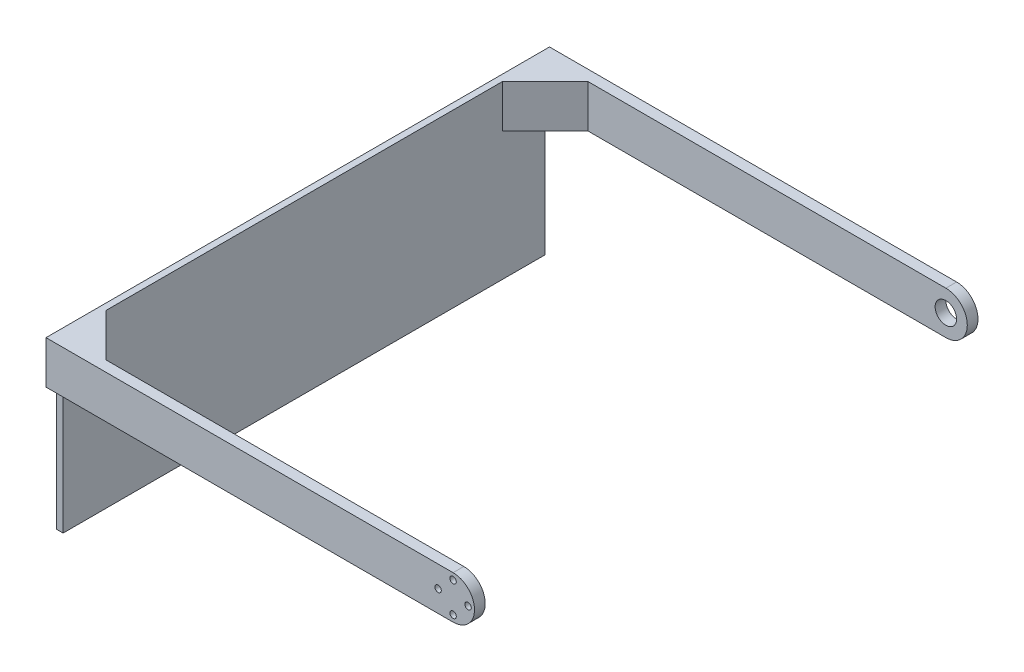
ISO-10303-21;
HEADER;
FILE_DESCRIPTION(('STEP AP214'),'2;1');
FILE_NAME('part.step','',(''),(''),'','','');
FILE_SCHEMA(('AUTOMOTIVE_DESIGN { 1 0 10303 214 1 1 1 1 }'));
ENDSEC;
DATA;
#1=APPLICATION_CONTEXT('core data for automotive mechanical design processes');
#2=APPLICATION_PROTOCOL_DEFINITION('international standard','automotive_design',2000,#1);
#3=PRODUCT_CONTEXT('',#1,'mechanical');
#4=PRODUCT('Part','Part','',(#3));
#5=PRODUCT_RELATED_PRODUCT_CATEGORY('part','',(#4));
#6=PRODUCT_DEFINITION_FORMATION('','',#4);
#7=PRODUCT_DEFINITION_CONTEXT('part definition',#1,'design');
#8=PRODUCT_DEFINITION('design','',#6,#7);
#9=PRODUCT_DEFINITION_SHAPE('','',#8);
#10=(LENGTH_UNIT() NAMED_UNIT(*) SI_UNIT(.MILLI.,.METRE.));
#11=(NAMED_UNIT(*) PLANE_ANGLE_UNIT() SI_UNIT($,.RADIAN.));
#12=(NAMED_UNIT(*) SI_UNIT($,.STERADIAN.) SOLID_ANGLE_UNIT());
#13=UNCERTAINTY_MEASURE_WITH_UNIT(LENGTH_MEASURE(1.E-05),#10,'distance_accuracy_value','');
#14=(GEOMETRIC_REPRESENTATION_CONTEXT(3) GLOBAL_UNCERTAINTY_ASSIGNED_CONTEXT((#13)) GLOBAL_UNIT_ASSIGNED_CONTEXT((#10,
#11,#12)) REPRESENTATION_CONTEXT('',''));
#15=CARTESIAN_POINT('',(0.,0.,0.));
#16=DIRECTION('',(0.,0.,1.));
#17=DIRECTION('',(1.,0.,0.));
#18=AXIS2_PLACEMENT_3D('',#15,#16,#17);
#19=CARTESIAN_POINT('',(0.,0.,-225.));
#20=DIRECTION('',(0.,0.,1.));
#21=DIRECTION('',(1.,0.,0.));
#22=AXIS2_PLACEMENT_3D('',#19,#20,#21);
#23=PLANE('',#22);
#24=DIRECTION('',(-1.,0.,0.));
#25=VECTOR('',#24,1.);
#26=CARTESIAN_POINT('',(0.,-10.,-225.));
#27=LINE('',#26,#25);
#28=CARTESIAN_POINT('',(-187.,-9.99999999999999,-225.));
#29=VERTEX_POINT('',#28);
#30=CARTESIAN_POINT('',(-190.,-9.99999999999998,-225.));
#31=VERTEX_POINT('',#30);
#32=EDGE_CURVE('E11',#29,#31,#27,.T.);
#33=ORIENTED_EDGE('',*,*,#32,.F.);
#34=DIRECTION('',(0.,-1.,0.));
#35=VECTOR('',#34,1.);
#36=CARTESIAN_POINT('',(-187.,-9.99999999999998,-225.));
#37=LINE('',#36,#35);
#38=CARTESIAN_POINT('',(-187.,-70.,-225.));
#39=VERTEX_POINT('',#38);
#40=EDGE_CURVE('E163',#29,#39,#37,.T.);
#41=ORIENTED_EDGE('',*,*,#40,.T.);
#42=DIRECTION('',(-1.,0.,0.));
#43=VECTOR('',#42,1.);
#44=CARTESIAN_POINT('',(-187.,-70.,-225.));
#45=LINE('',#44,#43);
#46=CARTESIAN_POINT('',(-190.,-70.,-225.));
#47=VERTEX_POINT('',#46);
#48=EDGE_CURVE('E224',#39,#47,#45,.T.);
#49=ORIENTED_EDGE('',*,*,#48,.T.);
#50=DIRECTION('',(0.,1.,0.));
#51=VECTOR('',#50,1.);
#52=CARTESIAN_POINT('',(-190.,-70.,-225.));
#53=LINE('',#52,#51);
#54=EDGE_CURVE('E228',#47,#31,#53,.T.);
#55=ORIENTED_EDGE('',*,*,#54,.T.);
#56=EDGE_LOOP('',(#33,#41,#49,#55));
#57=FACE_BOUND('',#56,.T.);
#58=ADVANCED_FACE('F39',(#57),#23,.F.);
#59=CARTESIAN_POINT('',(0.,0.,0.));
#60=DIRECTION('',(0.,0.,1.));
#61=DIRECTION('',(1.,0.,0.));
#62=AXIS2_PLACEMENT_3D('',#59,#60,#61);
#63=PLANE('',#62);
#64=CARTESIAN_POINT('',(0.,7.,0.));
#65=DIRECTION('',(0.,0.,1.));
#66=DIRECTION('',(1.,0.,0.));
#67=AXIS2_PLACEMENT_3D('',#64,#65,#66);
#68=CIRCLE('',#67,1.5);
#69=CARTESIAN_POINT('',(1.5,7.,0.));
#70=VERTEX_POINT('',#69);
#71=EDGE_CURVE('E251',#70,#70,#68,.T.);
#72=ORIENTED_EDGE('',*,*,#71,.T.);
#73=EDGE_LOOP('',(#72));
#74=FACE_BOUND('',#73,.T.);
#75=CARTESIAN_POINT('',(-7.,0.,0.));
#76=DIRECTION('',(0.,0.,1.));
#77=DIRECTION('',(1.,0.,0.));
#78=AXIS2_PLACEMENT_3D('',#75,#76,#77);
#79=CIRCLE('',#78,1.5);
#80=CARTESIAN_POINT('',(-5.5,0.,0.));
#81=VERTEX_POINT('',#80);
#82=EDGE_CURVE('E256',#81,#81,#79,.T.);
#83=ORIENTED_EDGE('',*,*,#82,.T.);
#84=EDGE_LOOP('',(#83));
#85=FACE_BOUND('',#84,.T.);
#86=CARTESIAN_POINT('',(0.,-7.,0.));
#87=DIRECTION('',(0.,0.,1.));
#88=DIRECTION('',(1.,0.,0.));
#89=AXIS2_PLACEMENT_3D('',#86,#87,#88);
#90=CIRCLE('',#89,1.5);
#91=CARTESIAN_POINT('',(1.5,-7.,0.));
#92=VERTEX_POINT('',#91);
#93=EDGE_CURVE('E264',#92,#92,#90,.T.);
#94=ORIENTED_EDGE('',*,*,#93,.T.);
#95=EDGE_LOOP('',(#94));
#96=FACE_BOUND('',#95,.T.);
#97=CARTESIAN_POINT('',(7.,0.,0.));
#98=DIRECTION('',(0.,0.,1.));
#99=DIRECTION('',(1.,0.,0.));
#100=AXIS2_PLACEMENT_3D('',#97,#98,#99);
#101=CIRCLE('',#100,1.5);
#102=CARTESIAN_POINT('',(8.5,0.,0.));
#103=VERTEX_POINT('',#102);
#104=EDGE_CURVE('E272',#103,#103,#101,.T.);
#105=ORIENTED_EDGE('',*,*,#104,.T.);
#106=EDGE_LOOP('',(#105));
#107=FACE_BOUND('',#106,.T.);
#108=DIRECTION('',(1.,0.,0.));
#109=VECTOR('',#108,1.);
#110=CARTESIAN_POINT('',(-190.,-9.99999999999998,0.));
#111=LINE('',#110,#109);
#112=CARTESIAN_POINT('',(-167.,-10.,0.));
#113=VERTEX_POINT('',#112);
#114=CARTESIAN_POINT('',(0.,-10.,0.));
#115=VERTEX_POINT('',#114);
#116=EDGE_CURVE('E305',#113,#115,#111,.T.);
#117=ORIENTED_EDGE('',*,*,#116,.F.);
#118=DIRECTION('',(0.,-1.,0.));
#119=VECTOR('',#118,1.);
#120=CARTESIAN_POINT('',(-167.,0.,0.));
#121=LINE('',#120,#119);
#122=CARTESIAN_POINT('',(-167.,9.99999999999998,0.));
#123=VERTEX_POINT('',#122);
#124=EDGE_CURVE('E64',#113,#123,#121,.F.);
#125=ORIENTED_EDGE('',*,*,#124,.T.);
#126=DIRECTION('',(-1.,0.,0.));
#127=VECTOR('',#126,1.);
#128=CARTESIAN_POINT('',(0.,10.,0.));
#129=LINE('',#128,#127);
#130=CARTESIAN_POINT('',(0.,10.,0.));
#131=VERTEX_POINT('',#130);
#132=EDGE_CURVE('E302',#131,#123,#129,.T.);
#133=ORIENTED_EDGE('',*,*,#132,.F.);
#134=CARTESIAN_POINT('',(0.,0.,0.));
#135=DIRECTION('',(0.,0.,1.));
#136=DIRECTION('',(1.,0.,0.));
#137=AXIS2_PLACEMENT_3D('',#134,#135,#136);
#138=CIRCLE('',#137,10.);
#139=EDGE_CURVE('E280',#115,#131,#138,.T.);
#140=ORIENTED_EDGE('',*,*,#139,.F.);
#141=EDGE_LOOP('',(#117,#125,#133,#140));
#142=FACE_BOUND('',#141,.T.);
#143=ADVANCED_FACE('F336',(#74,#85,#96,#107,#142),#63,.F.);
#144=CARTESIAN_POINT('',(0.,0.,5.));
#145=DIRECTION('',(0.,0.,1.));
#146=DIRECTION('',(1.,0.,0.));
#147=AXIS2_PLACEMENT_3D('',#144,#145,#146);
#148=PLANE('',#147);
#149=DIRECTION('',(-1.,0.,0.));
#150=VECTOR('',#149,1.);
#151=CARTESIAN_POINT('',(0.,10.,5.));
#152=LINE('',#151,#150);
#153=CARTESIAN_POINT('',(0.,10.,5.));
#154=VERTEX_POINT('',#153);
#155=CARTESIAN_POINT('',(-190.,9.99999999999998,5.));
#156=VERTEX_POINT('',#155);
#157=EDGE_CURVE('E288',#154,#156,#152,.T.);
#158=ORIENTED_EDGE('',*,*,#157,.T.);
#159=DIRECTION('',(0.,-1.,0.));
#160=VECTOR('',#159,1.);
#161=CARTESIAN_POINT('',(-190.,9.99999999999998,5.));
#162=LINE('',#161,#160);
#163=CARTESIAN_POINT('',(-190.,-9.99999999999998,5.));
#164=VERTEX_POINT('',#163);
#165=EDGE_CURVE('E292',#156,#164,#162,.T.);
#166=ORIENTED_EDGE('',*,*,#165,.T.);
#167=DIRECTION('',(1.,0.,0.));
#168=VECTOR('',#167,1.);
#169=CARTESIAN_POINT('',(-190.,-9.99999999999998,5.));
#170=LINE('',#169,#168);
#171=CARTESIAN_POINT('',(0.,-10.,5.));
#172=VERTEX_POINT('',#171);
#173=EDGE_CURVE('E295',#164,#172,#170,.T.);
#174=ORIENTED_EDGE('',*,*,#173,.T.);
#175=CARTESIAN_POINT('',(0.,0.,5.));
#176=DIRECTION('',(0.,0.,1.));
#177=DIRECTION('',(1.,0.,0.));
#178=AXIS2_PLACEMENT_3D('',#175,#176,#177);
#179=CIRCLE('',#178,10.);
#180=EDGE_CURVE('E284',#172,#154,#179,.T.);
#181=ORIENTED_EDGE('',*,*,#180,.T.);
#182=EDGE_LOOP('',(#158,#166,#174,#181));
#183=FACE_BOUND('',#182,.T.);
#184=CARTESIAN_POINT('',(-7.,0.,5.));
#185=DIRECTION('',(0.,0.,1.));
#186=DIRECTION('',(1.,0.,0.));
#187=AXIS2_PLACEMENT_3D('',#184,#185,#186);
#188=CIRCLE('',#187,1.5);
#189=CARTESIAN_POINT('',(-5.5,0.,5.));
#190=VERTEX_POINT('',#189);
#191=EDGE_CURVE('E260',#190,#190,#188,.T.);
#192=ORIENTED_EDGE('',*,*,#191,.F.);
#193=EDGE_LOOP('',(#192));
#194=FACE_BOUND('',#193,.T.);
#195=CARTESIAN_POINT('',(7.,0.,5.));
#196=DIRECTION('',(0.,0.,1.));
#197=DIRECTION('',(1.,0.,0.));
#198=AXIS2_PLACEMENT_3D('',#195,#196,#197);
#199=CIRCLE('',#198,1.5);
#200=CARTESIAN_POINT('',(8.5,0.,5.));
#201=VERTEX_POINT('',#200);
#202=EDGE_CURVE('E276',#201,#201,#199,.T.);
#203=ORIENTED_EDGE('',*,*,#202,.F.);
#204=EDGE_LOOP('',(#203));
#205=FACE_BOUND('',#204,.T.);
#206=CARTESIAN_POINT('',(0.,-7.,5.));
#207=DIRECTION('',(0.,0.,1.));
#208=DIRECTION('',(1.,0.,0.));
#209=AXIS2_PLACEMENT_3D('',#206,#207,#208);
#210=CIRCLE('',#209,1.5);
#211=CARTESIAN_POINT('',(1.5,-7.,5.));
#212=VERTEX_POINT('',#211);
#213=EDGE_CURVE('E268',#212,#212,#210,.T.);
#214=ORIENTED_EDGE('',*,*,#213,.F.);
#215=EDGE_LOOP('',(#214));
#216=FACE_BOUND('',#215,.T.);
#217=CARTESIAN_POINT('',(0.,7.,5.));
#218=DIRECTION('',(0.,0.,1.));
#219=DIRECTION('',(1.,0.,0.));
#220=AXIS2_PLACEMENT_3D('',#217,#218,#219);
#221=CIRCLE('',#220,1.5);
#222=CARTESIAN_POINT('',(1.5,7.,5.));
#223=VERTEX_POINT('',#222);
#224=EDGE_CURVE('E252',#223,#223,#221,.T.);
#225=ORIENTED_EDGE('',*,*,#224,.F.);
#226=EDGE_LOOP('',(#225));
#227=FACE_BOUND('',#226,.T.);
#228=ADVANCED_FACE('F346',(#183,#194,#205,#216,#227),#148,.T.);
#229=CARTESIAN_POINT('',(0.,0.,5.));
#230=DIRECTION('',(0.,0.,-1.));
#231=DIRECTION('',(-1.,0.,0.));
#232=AXIS2_PLACEMENT_3D('',#229,#230,#231);
#233=CYLINDRICAL_SURFACE('',#232,10.);
#234=ORIENTED_EDGE('',*,*,#139,.T.);
#235=DIRECTION('',(0.,0.,-1.));
#236=VECTOR('',#235,1.);
#237=CARTESIAN_POINT('',(0.,10.,5.));
#238=LINE('',#237,#236);
#239=EDGE_CURVE('E318',#154,#131,#238,.T.);
#240=ORIENTED_EDGE('',*,*,#239,.F.);
#241=ORIENTED_EDGE('',*,*,#180,.F.);
#242=DIRECTION('',(0.,0.,-1.));
#243=VECTOR('',#242,1.);
#244=CARTESIAN_POINT('',(0.,-10.,5.));
#245=LINE('',#244,#243);
#246=EDGE_CURVE('E298',#172,#115,#245,.T.);
#247=ORIENTED_EDGE('',*,*,#246,.T.);
#248=EDGE_LOOP('',(#234,#240,#241,#247));
#249=FACE_BOUND('',#248,.T.);
#250=ADVANCED_FACE('F41',(#249),#233,.T.);
#251=CARTESIAN_POINT('',(0.,10.,5.));
#252=DIRECTION('',(0.,-1.,0.));
#253=DIRECTION('',(1.,0.,0.));
#254=AXIS2_PLACEMENT_3D('',#251,#252,#253);
#255=PLANE('',#254);
#256=DIRECTION('',(1.,0.,0.));
#257=VECTOR('',#256,1.);
#258=CARTESIAN_POINT('',(-190.,9.99999999999998,-230.));
#259=LINE('',#258,#257);
#260=CARTESIAN_POINT('',(-190.,9.99999999999998,-230.));
#261=VERTEX_POINT('',#260);
#262=CARTESIAN_POINT('',(0.,10.,-230.));
#263=VERTEX_POINT('',#262);
#264=EDGE_CURVE('E191',#261,#263,#259,.T.);
#265=ORIENTED_EDGE('',*,*,#264,.F.);
#266=DIRECTION('',(0.,0.,-1.));
#267=VECTOR('',#266,1.);
#268=CARTESIAN_POINT('',(-190.,9.99999999999998,5.));
#269=LINE('',#268,#267);
#270=EDGE_CURVE('E315',#156,#261,#269,.T.);
#271=ORIENTED_EDGE('',*,*,#270,.F.);
#272=ORIENTED_EDGE('',*,*,#157,.F.);
#273=ORIENTED_EDGE('',*,*,#239,.T.);
#274=ORIENTED_EDGE('',*,*,#132,.T.);
#275=DIRECTION('',(0.707106781186547,0.,0.707106781186548));
#276=VECTOR('',#275,1.);
#277=CARTESIAN_POINT('',(-187.,9.99999999999998,-20.));
#278=LINE('',#277,#276);
#279=CARTESIAN_POINT('',(-187.,9.99999999999998,-20.));
#280=VERTEX_POINT('',#279);
#281=EDGE_CURVE('E212',#280,#123,#278,.T.);
#282=ORIENTED_EDGE('',*,*,#281,.F.);
#283=DIRECTION('',(0.,0.,1.));
#284=VECTOR('',#283,1.);
#285=CARTESIAN_POINT('',(-187.,9.99999999999998,-225.));
#286=LINE('',#285,#284);
#287=CARTESIAN_POINT('',(-187.,9.99999999999998,-205.));
#288=VERTEX_POINT('',#287);
#289=EDGE_CURVE('E248',#288,#280,#286,.T.);
#290=ORIENTED_EDGE('',*,*,#289,.F.);
#291=DIRECTION('',(0.707106781186547,0.,-0.707106781186548));
#292=VECTOR('',#291,1.);
#293=CARTESIAN_POINT('',(-187.,9.99999999999998,-205.));
#294=LINE('',#293,#292);
#295=CARTESIAN_POINT('',(-167.,9.99999999999998,-225.));
#296=VERTEX_POINT('',#295);
#297=EDGE_CURVE('E148',#288,#296,#294,.T.);
#298=ORIENTED_EDGE('',*,*,#297,.T.);
#299=DIRECTION('',(1.,0.,0.));
#300=VECTOR('',#299,1.);
#301=CARTESIAN_POINT('',(-190.,9.99999999999998,-225.));
#302=LINE('',#301,#300);
#303=CARTESIAN_POINT('',(0.,10.,-225.));
#304=VERTEX_POINT('',#303);
#305=EDGE_CURVE('E184',#296,#304,#302,.T.);
#306=ORIENTED_EDGE('',*,*,#305,.T.);
#307=DIRECTION('',(0.,0.,1.));
#308=VECTOR('',#307,1.);
#309=CARTESIAN_POINT('',(0.,10.,-230.));
#310=LINE('',#309,#308);
#311=EDGE_CURVE('E194',#263,#304,#310,.T.);
#312=ORIENTED_EDGE('',*,*,#311,.F.);
#313=EDGE_LOOP('',(#265,#271,#272,#273,#274,#282,#290,#298,#306,#312));
#314=FACE_BOUND('',#313,.T.);
#315=ADVANCED_FACE('F333',(#314),#255,.F.);
#316=CARTESIAN_POINT('',(-190.,9.99999999999998,5.));
#317=DIRECTION('',(1.,0.,0.));
#318=DIRECTION('',(0.,0.,-1.));
#319=AXIS2_PLACEMENT_3D('',#316,#317,#318);
#320=PLANE('',#319);
#321=ORIENTED_EDGE('',*,*,#270,.T.);
#322=DIRECTION('',(0.,1.,0.));
#323=VECTOR('',#322,1.);
#324=CARTESIAN_POINT('',(-190.,-9.99999999999998,-230.));
#325=LINE('',#324,#323);
#326=CARTESIAN_POINT('',(-190.,-9.99999999999998,-230.));
#327=VERTEX_POINT('',#326);
#328=EDGE_CURVE('E187',#327,#261,#325,.T.);
#329=ORIENTED_EDGE('',*,*,#328,.F.);
#330=DIRECTION('',(0.,0.,1.));
#331=VECTOR('',#330,1.);
#332=CARTESIAN_POINT('',(-190.,-9.99999999999998,-230.));
#333=LINE('',#332,#331);
#334=EDGE_CURVE('E204',#327,#31,#333,.T.);
#335=ORIENTED_EDGE('',*,*,#334,.T.);
#336=ORIENTED_EDGE('',*,*,#54,.F.);
#337=DIRECTION('',(0.,0.,1.));
#338=VECTOR('',#337,1.);
#339=CARTESIAN_POINT('',(-190.,-70.,-225.));
#340=LINE('',#339,#338);
#341=CARTESIAN_POINT('',(-190.,-70.,0.));
#342=VERTEX_POINT('',#341);
#343=EDGE_CURVE('E231',#47,#342,#340,.T.);
#344=ORIENTED_EDGE('',*,*,#343,.T.);
#345=DIRECTION('',(0.,1.,0.));
#346=VECTOR('',#345,1.);
#347=CARTESIAN_POINT('',(-190.,9.99999999999998,0.));
#348=LINE('',#347,#346);
#349=CARTESIAN_POINT('',(-190.,-9.99999999999998,0.));
#350=VERTEX_POINT('',#349);
#351=EDGE_CURVE('E225',#342,#350,#348,.T.);
#352=ORIENTED_EDGE('',*,*,#351,.T.);
#353=DIRECTION('',(0.,0.,-1.));
#354=VECTOR('',#353,1.);
#355=CARTESIAN_POINT('',(-190.,-9.99999999999998,5.));
#356=LINE('',#355,#354);
#357=EDGE_CURVE('E312',#164,#350,#356,.T.);
#358=ORIENTED_EDGE('',*,*,#357,.F.);
#359=ORIENTED_EDGE('',*,*,#165,.F.);
#360=EDGE_LOOP('',(#321,#329,#335,#336,#344,#352,#358,#359));
#361=FACE_BOUND('',#360,.T.);
#362=ADVANCED_FACE('F351',(#361),#320,.F.);
#363=CARTESIAN_POINT('',(-190.,-9.99999999999998,5.));
#364=DIRECTION('',(0.,1.,0.));
#365=DIRECTION('',(-1.,0.,0.));
#366=AXIS2_PLACEMENT_3D('',#363,#364,#365);
#367=PLANE('',#366);
#368=CARTESIAN_POINT('',(-187.,-9.99999999999999,0.));
#369=VERTEX_POINT('',#368);
#370=EDGE_CURVE('E289',#350,#369,#111,.T.);
#371=ORIENTED_EDGE('',*,*,#370,.T.);
#372=DIRECTION('',(0.,0.,-1.));
#373=VECTOR('',#372,1.);
#374=CARTESIAN_POINT('',(-187.,-10.,-225.));
#375=LINE('',#374,#373);
#376=CARTESIAN_POINT('',(-187.,-10.,-20.));
#377=VERTEX_POINT('',#376);
#378=EDGE_CURVE('E321',#369,#377,#375,.T.);
#379=ORIENTED_EDGE('',*,*,#378,.T.);
#380=DIRECTION('',(0.707106781186547,0.,0.707106781186548));
#381=VECTOR('',#380,1.);
#382=CARTESIAN_POINT('',(-187.,-10.,-20.));
#383=LINE('',#382,#381);
#384=EDGE_CURVE('E211',#377,#113,#383,.T.);
#385=ORIENTED_EDGE('',*,*,#384,.T.);
#386=ORIENTED_EDGE('',*,*,#116,.T.);
#387=ORIENTED_EDGE('',*,*,#246,.F.);
#388=ORIENTED_EDGE('',*,*,#173,.F.);
#389=ORIENTED_EDGE('',*,*,#357,.T.);
#390=EDGE_LOOP('',(#371,#379,#385,#386,#387,#388,#389));
#391=FACE_BOUND('',#390,.T.);
#392=ADVANCED_FACE('F341',(#391),#367,.F.);
#393=CARTESIAN_POINT('',(7.,0.,5.));
#394=DIRECTION('',(0.,0.,-1.));
#395=DIRECTION('',(-1.,0.,0.));
#396=AXIS2_PLACEMENT_3D('',#393,#394,#395);
#397=CYLINDRICAL_SURFACE('',#396,1.5);
#398=ORIENTED_EDGE('',*,*,#202,.T.);
#399=EDGE_LOOP('',(#398));
#400=FACE_BOUND('',#399,.T.);
#401=ORIENTED_EDGE('',*,*,#104,.F.);
#402=EDGE_LOOP('',(#401));
#403=FACE_BOUND('',#402,.T.);
#404=ADVANCED_FACE('F412',(#400,#403),#397,.F.);
#405=CARTESIAN_POINT('',(0.,-7.,5.));
#406=DIRECTION('',(0.,0.,-1.));
#407=DIRECTION('',(-1.,0.,0.));
#408=AXIS2_PLACEMENT_3D('',#405,#406,#407);
#409=CYLINDRICAL_SURFACE('',#408,1.5);
#410=ORIENTED_EDGE('',*,*,#213,.T.);
#411=EDGE_LOOP('',(#410));
#412=FACE_BOUND('',#411,.T.);
#413=ORIENTED_EDGE('',*,*,#93,.F.);
#414=EDGE_LOOP('',(#413));
#415=FACE_BOUND('',#414,.T.);
#416=ADVANCED_FACE('F408',(#412,#415),#409,.F.);
#417=CARTESIAN_POINT('',(-7.,0.,5.));
#418=DIRECTION('',(0.,0.,-1.));
#419=DIRECTION('',(-1.,0.,0.));
#420=AXIS2_PLACEMENT_3D('',#417,#418,#419);
#421=CYLINDRICAL_SURFACE('',#420,1.5);
#422=ORIENTED_EDGE('',*,*,#191,.T.);
#423=EDGE_LOOP('',(#422));
#424=FACE_BOUND('',#423,.T.);
#425=ORIENTED_EDGE('',*,*,#82,.F.);
#426=EDGE_LOOP('',(#425));
#427=FACE_BOUND('',#426,.T.);
#428=ADVANCED_FACE('F404',(#424,#427),#421,.F.);
#429=CARTESIAN_POINT('',(0.,7.,5.));
#430=DIRECTION('',(0.,0.,-1.));
#431=DIRECTION('',(-1.,0.,0.));
#432=AXIS2_PLACEMENT_3D('',#429,#430,#431);
#433=CYLINDRICAL_SURFACE('',#432,1.5);
#434=ORIENTED_EDGE('',*,*,#224,.T.);
#435=EDGE_LOOP('',(#434));
#436=FACE_BOUND('',#435,.T.);
#437=ORIENTED_EDGE('',*,*,#71,.F.);
#438=EDGE_LOOP('',(#437));
#439=FACE_BOUND('',#438,.T.);
#440=ADVANCED_FACE('F397',(#436,#439),#433,.F.);
#441=CARTESIAN_POINT('',(0.,0.,0.));
#442=DIRECTION('',(0.,0.,1.));
#443=DIRECTION('',(1.,0.,0.));
#444=AXIS2_PLACEMENT_3D('',#441,#442,#443);
#445=PLANE('',#444);
#446=ORIENTED_EDGE('',*,*,#370,.F.);
#447=ORIENTED_EDGE('',*,*,#351,.F.);
#448=DIRECTION('',(-1.,0.,0.));
#449=VECTOR('',#448,1.);
#450=CARTESIAN_POINT('',(-187.,-70.,0.));
#451=LINE('',#450,#449);
#452=CARTESIAN_POINT('',(-187.,-70.,0.));
#453=VERTEX_POINT('',#452);
#454=EDGE_CURVE('E234',#453,#342,#451,.T.);
#455=ORIENTED_EDGE('',*,*,#454,.F.);
#456=DIRECTION('',(0.,-1.,0.));
#457=VECTOR('',#456,1.);
#458=CARTESIAN_POINT('',(-187.,-9.99999999999998,0.));
#459=LINE('',#458,#457);
#460=EDGE_CURVE('E221',#369,#453,#459,.T.);
#461=ORIENTED_EDGE('',*,*,#460,.F.);
#462=EDGE_LOOP('',(#446,#447,#455,#461));
#463=FACE_BOUND('',#462,.T.);
#464=ADVANCED_FACE('F356',(#463),#445,.T.);
#465=CARTESIAN_POINT('',(-187.,-9.99999999999998,-225.));
#466=DIRECTION('',(-1.,0.,0.));
#467=DIRECTION('',(0.,0.,1.));
#468=AXIS2_PLACEMENT_3D('',#465,#466,#467);
#469=PLANE('',#468);
#470=DIRECTION('',(0.,0.,-1.));
#471=VECTOR('',#470,1.);
#472=CARTESIAN_POINT('',(-187.,-10.,-225.));
#473=LINE('',#472,#471);
#474=CARTESIAN_POINT('',(-187.,-10.,-205.));
#475=VERTEX_POINT('',#474);
#476=EDGE_CURVE('E56',#475,#29,#473,.T.);
#477=ORIENTED_EDGE('',*,*,#476,.F.);
#478=DIRECTION('',(0.,1.,0.));
#479=VECTOR('',#478,1.);
#480=CARTESIAN_POINT('',(-187.,-9.99999999999998,-205.));
#481=LINE('',#480,#479);
#482=EDGE_CURVE('E143',#475,#288,#481,.T.);
#483=ORIENTED_EDGE('',*,*,#482,.T.);
#484=ORIENTED_EDGE('',*,*,#289,.T.);
#485=DIRECTION('',(0.,1.,0.));
#486=VECTOR('',#485,1.);
#487=CARTESIAN_POINT('',(-187.,-10.,-20.));
#488=LINE('',#487,#486);
#489=EDGE_CURVE('E43',#280,#377,#488,.F.);
#490=ORIENTED_EDGE('',*,*,#489,.T.);
#491=ORIENTED_EDGE('',*,*,#378,.F.);
#492=ORIENTED_EDGE('',*,*,#460,.T.);
#493=DIRECTION('',(0.,0.,1.));
#494=VECTOR('',#493,1.);
#495=CARTESIAN_POINT('',(-187.,-70.,-225.));
#496=LINE('',#495,#494);
#497=EDGE_CURVE('E244',#39,#453,#496,.T.);
#498=ORIENTED_EDGE('',*,*,#497,.F.);
#499=ORIENTED_EDGE('',*,*,#40,.F.);
#500=EDGE_LOOP('',(#477,#483,#484,#490,#491,#492,#498,#499));
#501=FACE_BOUND('',#500,.T.);
#502=ADVANCED_FACE('F161',(#501),#469,.F.);
#503=CARTESIAN_POINT('',(-187.,-70.,-225.));
#504=DIRECTION('',(0.,1.,0.));
#505=DIRECTION('',(0.,0.,1.));
#506=AXIS2_PLACEMENT_3D('',#503,#504,#505);
#507=PLANE('',#506);
#508=ORIENTED_EDGE('',*,*,#454,.T.);
#509=ORIENTED_EDGE('',*,*,#343,.F.);
#510=ORIENTED_EDGE('',*,*,#48,.F.);
#511=ORIENTED_EDGE('',*,*,#497,.T.);
#512=EDGE_LOOP('',(#508,#509,#510,#511));
#513=FACE_BOUND('',#512,.T.);
#514=ADVANCED_FACE('F359',(#513),#507,.F.);
#515=CARTESIAN_POINT('',(-187.,9.99999999999998,-20.));
#516=DIRECTION('',(-0.707106781186548,0.,0.707106781186547));
#517=DIRECTION('',(0.707106781186547,0.,0.707106781186548));
#518=AXIS2_PLACEMENT_3D('',#515,#516,#517);
#519=PLANE('',#518);
#520=ORIENTED_EDGE('',*,*,#124,.F.);
#521=ORIENTED_EDGE('',*,*,#384,.F.);
#522=ORIENTED_EDGE('',*,*,#489,.F.);
#523=ORIENTED_EDGE('',*,*,#281,.T.);
#524=EDGE_LOOP('',(#520,#521,#522,#523));
#525=FACE_BOUND('',#524,.T.);
#526=ADVANCED_FACE('F330',(#525),#519,.F.);
#527=CARTESIAN_POINT('',(0.,0.,-225.));
#528=DIRECTION('',(0.,0.,-1.));
#529=DIRECTION('',(-1.,0.,0.));
#530=AXIS2_PLACEMENT_3D('',#527,#528,#529);
#531=PLANE('',#530);
#532=CARTESIAN_POINT('',(0.,0.,-225.));
#533=DIRECTION('',(0.,0.,-1.));
#534=DIRECTION('',(-1.,0.,0.));
#535=AXIS2_PLACEMENT_3D('',#532,#533,#534);
#536=CIRCLE('',#535,5.);
#537=CARTESIAN_POINT('',(-5.,0.,-225.));
#538=VERTEX_POINT('',#537);
#539=EDGE_CURVE('E152',#538,#538,#536,.T.);
#540=ORIENTED_EDGE('',*,*,#539,.T.);
#541=EDGE_LOOP('',(#540));
#542=FACE_BOUND('',#541,.T.);
#543=ORIENTED_EDGE('',*,*,#305,.F.);
#544=DIRECTION('',(0.,-1.,0.));
#545=VECTOR('',#544,1.);
#546=CARTESIAN_POINT('',(-167.,0.,-225.));
#547=LINE('',#546,#545);
#548=CARTESIAN_POINT('',(-167.,-10.,-225.));
#549=VERTEX_POINT('',#548);
#550=EDGE_CURVE('E153',#296,#549,#547,.T.);
#551=ORIENTED_EDGE('',*,*,#550,.T.);
#552=CARTESIAN_POINT('',(0.,-10.,-225.));
#553=VERTEX_POINT('',#552);
#554=EDGE_CURVE('E50',#553,#549,#27,.T.);
#555=ORIENTED_EDGE('',*,*,#554,.F.);
#556=CARTESIAN_POINT('',(0.,0.,-225.));
#557=DIRECTION('',(0.,0.,-1.));
#558=DIRECTION('',(-1.,0.,0.));
#559=AXIS2_PLACEMENT_3D('',#556,#557,#558);
#560=CIRCLE('',#559,10.);
#561=EDGE_CURVE('E175',#304,#553,#560,.T.);
#562=ORIENTED_EDGE('',*,*,#561,.F.);
#563=EDGE_LOOP('',(#543,#551,#555,#562));
#564=FACE_BOUND('',#563,.T.);
#565=ADVANCED_FACE('F375',(#542,#564),#531,.F.);
#566=CARTESIAN_POINT('',(0.,0.,-230.));
#567=DIRECTION('',(0.,0.,-1.));
#568=DIRECTION('',(-1.,0.,0.));
#569=AXIS2_PLACEMENT_3D('',#566,#567,#568);
#570=PLANE('',#569);
#571=DIRECTION('',(-1.,0.,0.));
#572=VECTOR('',#571,1.);
#573=CARTESIAN_POINT('',(0.,-10.,-230.));
#574=LINE('',#573,#572);
#575=CARTESIAN_POINT('',(0.,-10.,-230.));
#576=VERTEX_POINT('',#575);
#577=EDGE_CURVE('E183',#576,#327,#574,.T.);
#578=ORIENTED_EDGE('',*,*,#577,.T.);
#579=ORIENTED_EDGE('',*,*,#328,.T.);
#580=ORIENTED_EDGE('',*,*,#264,.T.);
#581=CARTESIAN_POINT('',(0.,0.,-230.));
#582=DIRECTION('',(0.,0.,-1.));
#583=DIRECTION('',(-1.,0.,0.));
#584=AXIS2_PLACEMENT_3D('',#581,#582,#583);
#585=CIRCLE('',#584,10.);
#586=EDGE_CURVE('E179',#263,#576,#585,.T.);
#587=ORIENTED_EDGE('',*,*,#586,.T.);
#588=EDGE_LOOP('',(#578,#579,#580,#587));
#589=FACE_BOUND('',#588,.T.);
#590=CARTESIAN_POINT('',(0.,0.,-230.));
#591=DIRECTION('',(0.,0.,-1.));
#592=DIRECTION('',(-1.,0.,0.));
#593=AXIS2_PLACEMENT_3D('',#590,#591,#592);
#594=CIRCLE('',#593,5.);
#595=CARTESIAN_POINT('',(-5.,0.,-230.));
#596=VERTEX_POINT('',#595);
#597=EDGE_CURVE('E171',#596,#596,#594,.T.);
#598=ORIENTED_EDGE('',*,*,#597,.F.);
#599=EDGE_LOOP('',(#598));
#600=FACE_BOUND('',#599,.T.);
#601=ADVANCED_FACE('F365',(#589,#600),#570,.T.);
#602=CARTESIAN_POINT('',(0.,0.,-230.));
#603=DIRECTION('',(0.,0.,1.));
#604=DIRECTION('',(1.,0.,0.));
#605=AXIS2_PLACEMENT_3D('',#602,#603,#604);
#606=CYLINDRICAL_SURFACE('',#605,10.);
#607=ORIENTED_EDGE('',*,*,#561,.T.);
#608=DIRECTION('',(0.,0.,1.));
#609=VECTOR('',#608,1.);
#610=CARTESIAN_POINT('',(0.,-10.,-230.));
#611=LINE('',#610,#609);
#612=EDGE_CURVE('E208',#576,#553,#611,.T.);
#613=ORIENTED_EDGE('',*,*,#612,.F.);
#614=ORIENTED_EDGE('',*,*,#586,.F.);
#615=ORIENTED_EDGE('',*,*,#311,.T.);
#616=EDGE_LOOP('',(#607,#613,#614,#615));
#617=FACE_BOUND('',#616,.T.);
#618=ADVANCED_FACE('F373',(#617),#606,.T.);
#619=CARTESIAN_POINT('',(0.,-10.,-230.));
#620=DIRECTION('',(0.,1.,0.));
#621=DIRECTION('',(-1.,0.,0.));
#622=AXIS2_PLACEMENT_3D('',#619,#620,#621);
#623=PLANE('',#622);
#624=ORIENTED_EDGE('',*,*,#554,.T.);
#625=DIRECTION('',(0.707106781186547,0.,-0.707106781186548));
#626=VECTOR('',#625,1.);
#627=CARTESIAN_POINT('',(-187.,-10.,-205.));
#628=LINE('',#627,#626);
#629=EDGE_CURVE('E145',#475,#549,#628,.T.);
#630=ORIENTED_EDGE('',*,*,#629,.F.);
#631=ORIENTED_EDGE('',*,*,#476,.T.);
#632=ORIENTED_EDGE('',*,*,#32,.T.);
#633=ORIENTED_EDGE('',*,*,#334,.F.);
#634=ORIENTED_EDGE('',*,*,#577,.F.);
#635=ORIENTED_EDGE('',*,*,#612,.T.);
#636=EDGE_LOOP('',(#624,#630,#631,#632,#633,#634,#635));
#637=FACE_BOUND('',#636,.T.);
#638=ADVANCED_FACE('F156',(#637),#623,.F.);
#639=CARTESIAN_POINT('',(0.,0.,-230.));
#640=DIRECTION('',(0.,0.,1.));
#641=DIRECTION('',(1.,0.,0.));
#642=AXIS2_PLACEMENT_3D('',#639,#640,#641);
#643=CYLINDRICAL_SURFACE('',#642,5.);
#644=ORIENTED_EDGE('',*,*,#597,.T.);
#645=EDGE_LOOP('',(#644));
#646=FACE_BOUND('',#645,.T.);
#647=ORIENTED_EDGE('',*,*,#539,.F.);
#648=EDGE_LOOP('',(#647));
#649=FACE_BOUND('',#648,.T.);
#650=ADVANCED_FACE('F512',(#646,#649),#643,.F.);
#651=CARTESIAN_POINT('',(-187.,9.99999999999998,-205.));
#652=DIRECTION('',(0.707106781186548,0.,0.707106781186547));
#653=DIRECTION('',(0.707106781186547,0.,-0.707106781186548));
#654=AXIS2_PLACEMENT_3D('',#651,#652,#653);
#655=PLANE('',#654);
#656=ORIENTED_EDGE('',*,*,#482,.F.);
#657=ORIENTED_EDGE('',*,*,#629,.T.);
#658=ORIENTED_EDGE('',*,*,#550,.F.);
#659=ORIENTED_EDGE('',*,*,#297,.F.);
#660=EDGE_LOOP('',(#656,#657,#658,#659));
#661=FACE_BOUND('',#660,.T.);
#662=ADVANCED_FACE('F144',(#661),#655,.T.);
#663=CLOSED_SHELL('',(#58,#143,#228,#250,#315,#362,#392,#404,#416,#428,#440,#464,#502,#514,#526,
#565,#601,#618,#638,#650,#662));
#664=MANIFOLD_SOLID_BREP('B2',#663);
#665=ADVANCED_BREP_SHAPE_REPRESENTATION('',(#18,#664),#14);
#666=SHAPE_DEFINITION_REPRESENTATION(#9,#665);
ENDSEC;
END-ISO-10303-21;
